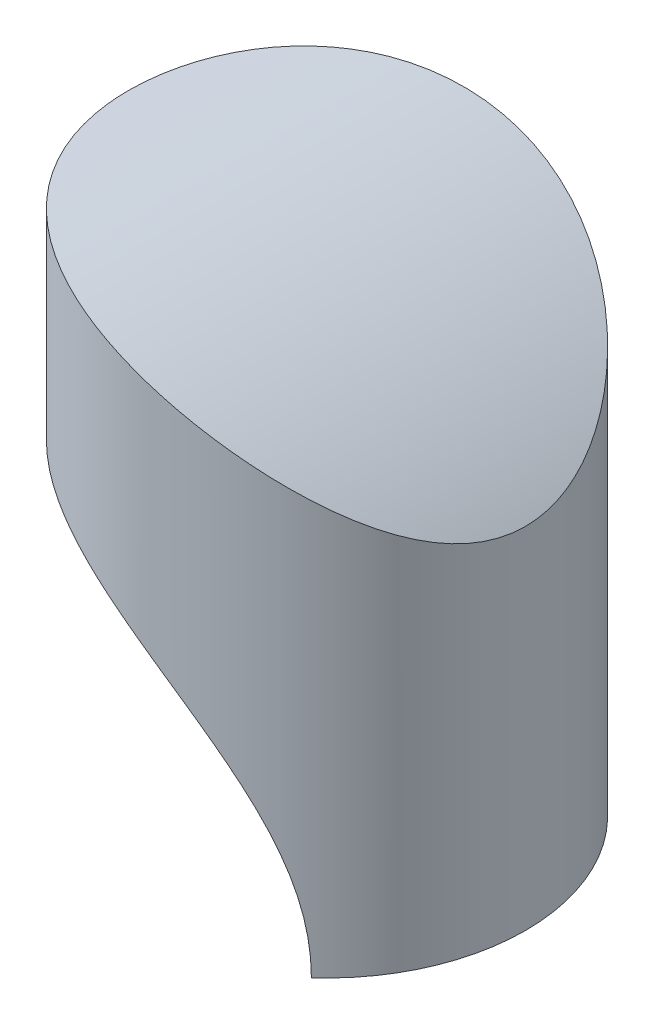
ISO-10303-21;
HEADER;
FILE_DESCRIPTION(('STEP AP214'),'2;1');
FILE_NAME('part.step','',(''),(''),'','','');
FILE_SCHEMA(('AUTOMOTIVE_DESIGN { 1 0 10303 214 1 1 1 1 }'));
ENDSEC;
DATA;
#1=APPLICATION_CONTEXT('core data for automotive mechanical design processes');
#2=APPLICATION_PROTOCOL_DEFINITION('international standard','automotive_design',2000,#1);
#3=PRODUCT_CONTEXT('',#1,'mechanical');
#4=PRODUCT('Part','Part','',(#3));
#5=PRODUCT_RELATED_PRODUCT_CATEGORY('part','',(#4));
#6=PRODUCT_DEFINITION_FORMATION('','',#4);
#7=PRODUCT_DEFINITION_CONTEXT('part definition',#1,'design');
#8=PRODUCT_DEFINITION('design','',#6,#7);
#9=PRODUCT_DEFINITION_SHAPE('','',#8);
#10=(LENGTH_UNIT() NAMED_UNIT(*) SI_UNIT(.MILLI.,.METRE.));
#11=(NAMED_UNIT(*) PLANE_ANGLE_UNIT() SI_UNIT($,.RADIAN.));
#12=(NAMED_UNIT(*) SI_UNIT($,.STERADIAN.) SOLID_ANGLE_UNIT());
#13=UNCERTAINTY_MEASURE_WITH_UNIT(LENGTH_MEASURE(1.E-05),#10,'distance_accuracy_value','');
#14=(GEOMETRIC_REPRESENTATION_CONTEXT(3) GLOBAL_UNCERTAINTY_ASSIGNED_CONTEXT((#13)) GLOBAL_UNIT_ASSIGNED_CONTEXT((#10,
#11,#12)) REPRESENTATION_CONTEXT('',''));
#15=CARTESIAN_POINT('',(0.,0.,0.));
#16=DIRECTION('',(0.,0.,1.));
#17=DIRECTION('',(1.,0.,0.));
#18=AXIS2_PLACEMENT_3D('',#15,#16,#17);
#19=CARTESIAN_POINT('',(0.,80.,0.));
#20=DIRECTION('',(0.,-1.,0.));
#21=DIRECTION('',(0.,0.,-1.));
#22=AXIS2_PLACEMENT_3D('',#19,#20,#21);
#23=CYLINDRICAL_SURFACE('',#22,30.);
#24=CARTESIAN_POINT('',(20.,0.,22.3606797749979));
#25=CARTESIAN_POINT('',(20.0000007120072,0.322032795196168,22.3606754142788));
#26=CARTESIAN_POINT('',(19.9968885845418,0.644050729541473,22.3634631745397));
#27=CARTESIAN_POINT('',(19.9844481767636,1.28786526828124,22.3745822765455));
#28=CARTESIAN_POINT('',(19.9751200045152,1.60966187642605,22.3829135219184));
#29=CARTESIAN_POINT('',(19.9378323530027,2.57427303249348,22.4161555757134));
#30=CARTESIAN_POINT('',(19.9005697280598,3.21648542726856,22.4493147447179));
#31=CARTESIAN_POINT('',(19.8015663972087,4.4961051697141,22.5366873813447));
#32=CARTESIAN_POINT('',(19.7398798930536,5.13351999377426,22.5908542230878));
#33=CARTESIAN_POINT('',(19.5923679631962,6.40357391360704,22.7189049766029));
#34=CARTESIAN_POINT('',(19.5065415422359,7.03621281136981,22.7927897013116));
#35=CARTESIAN_POINT('',(19.3118335351873,8.29117331845733,22.9579890602384));
#36=CARTESIAN_POINT('',(19.2031116775069,8.91353575917785,23.0491825273545));
#37=CARTESIAN_POINT('',(18.9627262922306,10.1513076896881,23.2473487904694));
#38=CARTESIAN_POINT('',(18.8310599445511,10.7667163148793,23.3543235258791));
#39=CARTESIAN_POINT('',(18.4022069215164,12.6017754874726,23.695836182878));
#40=CARTESIAN_POINT('',(18.0712273450615,13.8098681559307,23.9509086149779));
#41=CARTESIAN_POINT('',(17.265584003045,16.371731995908,24.5394474119059));
#42=CARTESIAN_POINT('',(16.7767019730055,17.7196037603295,24.8789368739185));
#43=CARTESIAN_POINT('',(15.6876435055173,20.3637891459652,25.579623080266));
#44=CARTESIAN_POINT('',(15.0874524925823,21.6600959879197,25.9408226632668));
#45=CARTESIAN_POINT('',(13.776795017178,24.1999685847225,26.6600824484979));
#46=CARTESIAN_POINT('',(13.0661189570018,25.4434282544687,27.0181352881789));
#47=CARTESIAN_POINT('',(11.5368265795367,27.8701873375007,27.7056718802995));
#48=CARTESIAN_POINT('',(10.7182497048609,29.0535085161619,28.0351659996363));
#49=CARTESIAN_POINT('',(9.20146466586302,31.0545600286145,28.5622052560136));
#50=CARTESIAN_POINT('',(8.52726729178211,31.887375304455,28.7717870837487));
#51=CARTESIAN_POINT('',(7.12179282099093,33.5130811473071,29.1514976781127));
#52=CARTESIAN_POINT('',(6.39051866712704,34.3059737692448,29.3216284770206));
#53=CARTESIAN_POINT('',(4.87475243586057,35.8457271392102,29.6113306343571));
#54=CARTESIAN_POINT('',(4.09037964023866,36.5926843111127,29.7310112195912));
#55=CARTESIAN_POINT('',(2.47074667790061,38.037178771342,29.9091734021724));
#56=CARTESIAN_POINT('',(1.63549851728752,38.7347276361629,29.9676693797467));
#57=CARTESIAN_POINT('',(0.101324041838263,39.9330381950979,30.0074611167176));
#58=CARTESIAN_POINT('',(-0.589114190069803,40.4442366260103,30.0024578112568));
#59=CARTESIAN_POINT('',(-1.99396092145654,41.4294266390447,29.9419140931503));
#60=CARTESIAN_POINT('',(-2.70836670299162,41.9034224197622,29.886379392282));
#61=CARTESIAN_POINT('',(-4.15580053915634,42.8112945850202,29.7196874813412));
#62=CARTESIAN_POINT('',(-4.88882402811233,43.2451806869606,29.608543785761));
#63=CARTESIAN_POINT('',(-6.36722260749556,44.07049379597,29.3261778489684));
#64=CARTESIAN_POINT('',(-7.11259782349516,44.4619203710737,29.1549549966109));
#65=CARTESIAN_POINT('',(-8.61303237496746,45.2029010936786,28.7475888129971));
#66=CARTESIAN_POINT('',(-9.36812315195129,45.5521604643577,28.5110226429953));
#67=CARTESIAN_POINT('',(-10.874362982846,46.2048016217451,27.9712024822774));
#68=CARTESIAN_POINT('',(-11.6255119978487,46.5081829564224,27.6679478345595));
#69=CARTESIAN_POINT('',(-13.1143742565686,47.0691881256482,26.9940867796003));
#70=CARTESIAN_POINT('',(-13.852090443627,47.3268220951215,26.6234953271348));
#71=CARTESIAN_POINT('',(-15.3048150724499,47.7978514797257,25.8157539120352));
#72=CARTESIAN_POINT('',(-16.0198254250402,48.0112506258694,25.3786095682436));
#73=CARTESIAN_POINT('',(-17.3433354622661,48.3759099505508,24.4902938408875));
#74=CARTESIAN_POINT('',(-17.9550515799704,48.5313736782875,24.0456144428462));
#75=CARTESIAN_POINT('',(-19.147244849467,48.8118087804994,23.1075360317343));
#76=CARTESIAN_POINT('',(-19.7277245549004,48.9367826505441,22.6141410106434));
#77=CARTESIAN_POINT('',(-20.8521866803901,49.1593954217406,21.5816823683517));
#78=CARTESIAN_POINT('',(-21.3961667304699,49.2570325491807,21.0426157867613));
#79=CARTESIAN_POINT('',(-22.4429677126788,49.4284599230223,19.9223728166638));
#80=CARTESIAN_POINT('',(-22.9457871322859,49.5022492933881,19.3411948821766));
#81=CARTESIAN_POINT('',(-23.9111155260234,49.6302832974213,18.1345403863541));
#82=CARTESIAN_POINT('',(-24.3731665934666,49.6843232193419,17.5086760313379));
#83=CARTESIAN_POINT('',(-25.2477327091232,49.7755896537559,16.2221163163369));
#84=CARTESIAN_POINT('',(-25.6602479362019,49.8128162269606,15.5614210821325));
#85=CARTESIAN_POINT('',(-26.432930528398,49.8741045461954,14.2093826939775));
#86=CARTESIAN_POINT('',(-26.7930890576256,49.8981640720007,13.5180343925458));
#87=CARTESIAN_POINT('',(-27.4586023119205,49.936483961115,12.1091773861067));
#88=CARTESIAN_POINT('',(-27.7639550445263,49.9507439682165,11.3916677311454));
#89=CARTESIAN_POINT('',(-28.3338101685395,49.9730911764176,9.89313275027178));
#90=CARTESIAN_POINT('',(-28.5949624252135,49.9807771511708,9.11082546349858));
#91=CARTESIAN_POINT('',(-29.0519959427058,49.9915349912337,7.52732920975946));
#92=CARTESIAN_POINT('',(-29.2478749657634,49.9946066983653,6.72613959645921));
#93=CARTESIAN_POINT('',(-29.5730343336472,49.9984417856567,5.11027156542155));
#94=CARTESIAN_POINT('',(-29.7023084205801,49.9992049489491,4.29559188763914));
#95=CARTESIAN_POINT('',(-29.8933506891409,49.9999775899747,2.65835772952854));
#96=CARTESIAN_POINT('',(-29.9551185925658,49.9999870646018,1.83580321676107));
#97=CARTESIAN_POINT('',(-30.0113435385118,50.0000073249414,0.17012593631239));
#98=CARTESIAN_POINT('',(-30.0042783182259,50.0000181350591,-0.673048622615571));
#99=CARTESIAN_POINT('',(-29.9192223460036,49.9999526042911,-2.35582379875937));
#100=CARTESIAN_POINT('',(-29.8412302441146,49.9998762617468,-3.19542434764544));
#101=CARTESIAN_POINT('',(-29.6148603705289,49.9986445401902,-4.86517667399609));
#102=CARTESIAN_POINT('',(-29.4664749660278,49.9974890441514,-5.69532741681236));
#103=CARTESIAN_POINT('',(-29.1003701868261,49.9922407644513,-7.34018748830894));
#104=CARTESIAN_POINT('',(-28.8826509747021,49.9881479876774,-8.15489685319201));
#105=CARTESIAN_POINT('',(-28.3791588023074,49.9743565540768,-9.76395193509776));
#106=CARTESIAN_POINT('',(-28.0933112296415,49.9646517343499,-10.5582742608298));
#107=CARTESIAN_POINT('',(-27.455772499908,49.9362458810625,-12.1198935841991));
#108=CARTESIAN_POINT('',(-27.1040809224778,49.9175447900666,-12.8871904092625));
#109=CARTESIAN_POINT('',(-26.3375003201844,49.8671591650064,-14.3891252195662));
#110=CARTESIAN_POINT('',(-25.922610570355,49.8354744819962,-15.1237628300374));
#111=CARTESIAN_POINT('',(-25.0329260261727,49.7546740356577,-16.5548307334744));
#112=CARTESIAN_POINT('',(-24.5581323281447,49.7055585913065,-17.2512617253395));
#113=CARTESIAN_POINT('',(-23.5596749276058,49.585999703438,-18.5911260730562));
#114=CARTESIAN_POINT('',(-23.0367848666217,49.5158631640434,-19.2351629532864));
#115=CARTESIAN_POINT('',(-21.9413268281061,49.3494132062156,-20.4759119298972));
#116=CARTESIAN_POINT('',(-21.3687592511697,49.2530999988552,-21.0726244078235));
#117=CARTESIAN_POINT('',(-20.1798101846198,49.0298828128749,-22.2138212543104));
#118=CARTESIAN_POINT('',(-19.5634521509425,48.9029951253602,-22.7583332217856));
#119=CARTESIAN_POINT('',(-18.29312430722,48.6145355751604,-23.791421008311));
#120=CARTESIAN_POINT('',(-17.6391566754518,48.452965719723,-24.2800000619982));
#121=CARTESIAN_POINT('',(-16.3376522039242,48.101655976305,-25.1727898170676));
#122=CARTESIAN_POINT('',(-15.6917307172196,47.9139477267398,-25.5801585067931));
#123=CARTESIAN_POINT('',(-14.3795496143165,47.5023597842692,-26.3401467622484));
#124=CARTESIAN_POINT('',(-13.7132909074591,47.2784817067144,-26.6927687715958));
#125=CARTESIAN_POINT('',(-12.3675923302082,46.7932649449712,-27.3422895659653));
#126=CARTESIAN_POINT('',(-11.6881551089748,46.5319337235383,-27.6391994248037));
#127=CARTESIAN_POINT('',(-10.3230202848477,45.9713051659784,-28.1775378301916));
#128=CARTESIAN_POINT('',(-9.63732264186882,45.6720075865957,-28.4189660212345));
#129=CARTESIAN_POINT('',(-8.28421424749744,45.0440511922714,-28.8420054626911));
#130=CARTESIAN_POINT('',(-7.61678931122461,44.7163522310963,-29.0250025699406));
#131=CARTESIAN_POINT('',(-6.28825900307218,44.0262836836153,-29.3415086448348));
#132=CARTESIAN_POINT('',(-5.62715335085035,43.6639156432581,-29.4750198178423));
#133=CARTESIAN_POINT('',(-4.31615984967432,42.9058718504079,-29.6953319020246));
#134=CARTESIAN_POINT('',(-3.66627523330004,42.5101866865924,-29.7821195633457));
#135=CARTESIAN_POINT('',(-2.38222694549023,41.6874135342486,-29.9122321078421));
#136=CARTESIAN_POINT('',(-1.74806547482792,41.2603211824583,-29.9555509397954));
#137=CARTESIAN_POINT('',(-0.266229887959806,40.2119984500436,-30.0110792880787));
#138=CARTESIAN_POINT('',(0.572938316142759,39.5777351900908,-30.0056786905613));
#139=CARTESIAN_POINT('',(2.20784237388017,38.2591042666739,-29.9298471619471));
#140=CARTESIAN_POINT('',(3.00356465452019,37.5747210997653,-29.8593960300645));
#141=CARTESIAN_POINT('',(4.54803244650715,36.1598144474205,-29.6634851409777));
#142=CARTESIAN_POINT('',(5.29669474729027,35.4292135755935,-29.5379309151686));
#143=CARTESIAN_POINT('',(6.74247477693096,33.9275312606899,-29.2418138714104));
#144=CARTESIAN_POINT('',(7.43959122210006,33.1564488102848,-29.0712499330307));
#145=CARTESIAN_POINT('',(9.01315813610168,31.3036630208063,-28.62940291721));
#146=CARTESIAN_POINT('',(9.86796519609071,30.2069702701242,-28.3437038663316));
#147=CARTESIAN_POINT('',(11.4787612637585,27.9541000039737,-27.7305082961085));
#148=CARTESIAN_POINT('',(12.2347100161591,26.7978985218533,-27.4029948564885));
#149=CARTESIAN_POINT('',(13.6473164719533,24.4298042397965,-26.7275945129411));
#150=CARTESIAN_POINT('',(14.3038325736173,23.2178351628543,-26.3796795146793));
#151=CARTESIAN_POINT('',(15.5148060958311,20.7436496582048,-25.6861325715226));
#152=CARTESIAN_POINT('',(16.0692895349248,19.4814461405168,-25.3405000663214));
#153=CARTESIAN_POINT('',(16.9992844992635,17.1011022825331,-24.7242319868118));
#154=CARTESIAN_POINT('',(17.3891499517116,15.9894718176954,-24.4500896071285));
#155=CARTESIAN_POINT('',(18.0912502692584,13.7341412475779,-23.9352511498763));
#156=CARTESIAN_POINT('',(18.4034791524828,12.5904386787025,-23.6945576501633));
#157=CARTESIAN_POINT('',(18.9462832196207,10.2792748952481,-23.2628192732327));
#158=CARTESIAN_POINT('',(19.1771851212141,9.1119291394487,-23.0715765789261));
#159=CARTESIAN_POINT('',(19.4611490931167,7.34511777006618,-22.8315291795313));
#160=CARTESIAN_POINT('',(19.5453963071855,6.75365350663491,-22.7593247033559));
#161=CARTESIAN_POINT('',(19.6927942690486,5.56631123475889,-22.6319123394848));
#162=CARTESIAN_POINT('',(19.7559484895695,4.97043396939474,-22.5767016540683));
#163=CARTESIAN_POINT('',(19.8402424451633,4.01033718995873,-22.5025893759362));
#164=CARTESIAN_POINT('',(19.8681391058943,3.64712933464437,-22.4779461591788));
#165=CARTESIAN_POINT('',(19.9160021551838,2.91984506761127,-22.4355496313517));
#166=CARTESIAN_POINT('',(19.9359699317511,2.55576881914709,-22.4177951143773));
#167=CARTESIAN_POINT('',(19.9679587280086,1.82658653861959,-22.3893078668389));
#168=CARTESIAN_POINT('',(19.9799708590825,1.46147981089019,-22.3785829904299));
#169=CARTESIAN_POINT('',(19.9959932492489,0.73091628121026,-22.3642632935865));
#170=CARTESIAN_POINT('',(20.0000027398654,0.365459449010935,-22.3606691579018));
#171=CARTESIAN_POINT('',(20.,0.,-22.3606797749979));
#172=B_SPLINE_CURVE_WITH_KNOTS('',3,(#24,#25,#26,#27,#28,#29,#30,#31,#32,#33,#34,#35,#36,#37,
#38,#39,#40,#41,#42,#43,#44,#45,#46,#47,#48,#49,#50,#51,#52,#53,#54,#55,#56,#57,#58,#59,#60,#61,
#62,#63,#64,#65,#66,#67,#68,#69,#70,#71,#72,#73,#74,#75,#76,#77,#78,#79,#80,#81,#82,#83,#84,#85,
#86,#87,#88,#89,#90,#91,#92,#93,#94,#95,#96,#97,#98,#99,#100,#101,#102,#103,#104,#105,#106,#107,
#108,#109,#110,#111,#112,#113,#114,#115,#116,#117,#118,#119,#120,#121,#122,#123,#124,#125,#126,
#127,#128,#129,#130,#131,#132,#133,#134,#135,#136,#137,#138,#139,#140,#141,#142,#143,#144,#145,
#146,#147,#148,#149,#150,#151,#152,#153,#154,#155,#156,#157,#158,#159,#160,#161,#162,#163,#164,
#165,#166,#167,#168,#169,#170,#171),.UNSPECIFIED.,.F.,.F.,(4,2,2,2,2,2,2,2,2,2,2,2,2,2,2,2,2,2,
2,2,2,2,2,2,2,2,2,2,2,2,2,2,2,2,2,2,2,2,2,2,2,2,2,2,2,2,2,2,2,2,2,2,2,2,2,2,2,2,2,2,2,2,2,2,2,2,
2,2,2,2,2,2,2,4),(0.,0.966041897173042,1.93206700041441,3.86358830300822,5.79084696322992,
7.71818509351831,9.63249812459345,11.5470466080633,15.3773381108382,19.7920871440596,
24.2074146805123,28.631222974111,33.0534186277066,36.3262656432966,39.5989440240817,
42.864500069493,46.129288438217,48.7042121366987,51.2788448168105,53.8528520951256,
56.4268855578533,59.0179824957424,61.609104961754,64.1996526693118,66.789981786575,
69.1034775099661,71.4167838120828,73.7302401755247,76.0437815129958,78.3806657123843,
80.7175414734424,83.0548111566925,85.3921657940368,87.8636618360035,90.3352425994933,
92.8070555390164,95.2788786652116,97.8054887556639,100.332146936136,102.859079146899,
105.386005432462,107.915711961897,110.445434642084,112.975186343701,115.50489175408,
117.999327774276,120.493743681431,122.986833408096,125.47977888484,127.835963185439,
130.192042287518,132.547652578225,134.90327796242,137.197964807966,139.492549377462,
141.787784302972,144.08333869994,147.234390350842,150.386420858199,153.543876437445,
156.701410622915,160.953916273063,165.20814819461,169.468382712619,173.727529351824,
177.352924667821,180.978599232935,184.589537505437,186.394374486242,188.198914174098,
189.294113457851,190.389120934388,191.485349776969,192.581683882948),.UNSPECIFIED.);
#173=CARTESIAN_POINT('',(20.,0.,22.3606797749979));
#174=VERTEX_POINT('',#173);
#175=CARTESIAN_POINT('',(20.,0.,-22.3606797749979));
#176=VERTEX_POINT('',#175);
#177=EDGE_CURVE('E46',#174,#176,#172,.T.);
#178=ORIENTED_EDGE('',*,*,#177,.F.);
#179=CARTESIAN_POINT('',(0.,0.,0.));
#180=DIRECTION('',(0.,1.,0.));
#181=DIRECTION('',(0.,0.,1.));
#182=AXIS2_PLACEMENT_3D('',#179,#180,#181);
#183=CIRCLE('',#182,30.);
#184=EDGE_CURVE('E41',#174,#176,#183,.T.);
#185=ORIENTED_EDGE('',*,*,#184,.T.);
#186=EDGE_LOOP('',(#178,#185));
#187=FACE_BOUND('',#186,.T.);
#188=CARTESIAN_POINT('',(-30.,80.,0.));
#189=CARTESIAN_POINT('',(-29.9999966696779,80.0000021177272,-0.841309037096398));
#190=CARTESIAN_POINT('',(-29.9645839884192,80.0000240843786,-1.68270371882417));
#191=CARTESIAN_POINT('',(-29.8231454257203,79.9998351067755,-3.35985631922953));
#192=CARTESIAN_POINT('',(-29.71708910666,79.9996240620998,-4.19561165127074));
#193=CARTESIAN_POINT('',(-29.4348368614637,79.9981283298476,-5.85673416004635));
#194=CARTESIAN_POINT('',(-29.2585166817126,79.9968417358365,-6.68208024743124));
#195=CARTESIAN_POINT('',(-28.8370152108803,79.9918234915545,-8.31489191769157));
#196=CARTESIAN_POINT('',(-28.59184141797,79.9880921074627,-9.12235943722222));
#197=CARTESIAN_POINT('',(-28.0345136483144,79.9763368132893,-10.7133636927642));
#198=CARTESIAN_POINT('',(-27.7223927205181,79.968315018293,-11.496912019429));
#199=CARTESIAN_POINT('',(-27.0333364942396,79.9457169612319,-13.0349064651485));
#200=CARTESIAN_POINT('',(-26.6563993858627,79.93114051612,-13.7893517708243));
#201=CARTESIAN_POINT('',(-25.8406480226079,79.8928429860922,-15.2633591789575));
#202=CARTESIAN_POINT('',(-25.4018602155906,79.8691258023518,-15.9829360156407));
#203=CARTESIAN_POINT('',(-24.4655737829413,79.8097115751842,-17.3823007796053));
#204=CARTESIAN_POINT('',(-23.9680759834456,79.7740147003158,-18.0620892665662));
#205=CARTESIAN_POINT('',(-22.9212343741437,79.6879237915482,-19.3730893471465));
#206=CARTESIAN_POINT('',(-22.3722060512882,79.6376156889729,-20.0045584362581));
#207=CARTESIAN_POINT('',(-21.2242467945278,79.5192994632617,-21.2186061591811));
#208=CARTESIAN_POINT('',(-20.6253159660054,79.4512913775033,-21.8011848962325));
#209=CARTESIAN_POINT('',(-19.382566187318,79.294780145688,-22.9131233912044));
#210=CARTESIAN_POINT('',(-18.7387537696237,79.2062799778984,-23.4424908666965));
#211=CARTESIAN_POINT('',(-17.4116572948421,79.0062261890648,-24.444331745295));
#212=CARTESIAN_POINT('',(-16.7283741205144,78.8946730834539,-24.9168064200749));
#213=CARTESIAN_POINT('',(-15.3448518830641,78.6492750006257,-25.7912654556278));
#214=CARTESIAN_POINT('',(-14.6453926892869,78.5160177655168,-26.1946494045429));
#215=CARTESIAN_POINT('',(-13.2205193650013,78.2238954407558,-26.9418817711387));
#216=CARTESIAN_POINT('',(-12.4951057454563,78.0650308550186,-27.2857313600917));
#217=CARTESIAN_POINT('',(-11.0246007204078,77.7206815312137,-27.9123067188471));
#218=CARTESIAN_POINT('',(-10.2795118474604,77.5352002056975,-28.1950403127467));
#219=CARTESIAN_POINT('',(-8.77581535878486,77.1371430551975,-28.6986720381361));
#220=CARTESIAN_POINT('',(-8.01720767954514,76.9245671028938,-28.9195698790391));
#221=CARTESIAN_POINT('',(-6.49657436048596,76.4736206066713,-29.2985557093956));
#222=CARTESIAN_POINT('',(-5.7345868632827,76.2353895869298,-29.4569635681979));
#223=CARTESIAN_POINT('',(-4.20907396534086,75.7329061485962,-29.7133297328095));
#224=CARTESIAN_POINT('',(-3.44554857856091,75.4686539651513,-29.8112885848242));
#225=CARTESIAN_POINT('',(-1.92211909493251,74.9152157303866,-29.9481302860721));
#226=CARTESIAN_POINT('',(-1.16221576382719,74.626024633704,-29.9870011515144));
#227=CARTESIAN_POINT('',(0.34904584528718,74.0243004413501,-30.0074882178661));
#228=CARTESIAN_POINT('',(1.10040376404374,73.7117663684799,-29.9891020205304));
#229=CARTESIAN_POINT('',(2.63988027410514,73.0437414965011,-29.8942239822885));
#230=CARTESIAN_POINT('',(3.42712543487998,72.6867762836061,-29.8139535494464));
#231=CARTESIAN_POINT('',(4.98278049382145,71.9509946161133,-29.5937351977433));
#232=CARTESIAN_POINT('',(5.75118970611643,71.5721773674985,-29.453785109176));
#233=CARTESIAN_POINT('',(7.26567134729984,70.7954383388863,-29.1172088070087));
#234=CARTESIAN_POINT('',(8.01174120861169,70.3975143764364,-28.920576105976));
#235=CARTESIAN_POINT('',(9.47854795964798,69.5855384715399,-28.4735854857867));
#236=CARTESIAN_POINT('',(10.1992835215365,69.1714856861309,-28.2232247554776));
#237=CARTESIAN_POINT('',(11.7108062351187,68.2721393648296,-27.6333681656122));
#238=CARTESIAN_POINT('',(12.497505709848,67.7849095564326,-27.2863350209572));
#239=CARTESIAN_POINT('',(14.0322092843032,66.7981815920321,-26.5297798737982));
#240=CARTESIAN_POINT('',(14.780209968514,66.29868235886,-26.1202523681623));
#241=CARTESIAN_POINT('',(16.2364038480195,65.2914996887842,-25.2409165193513));
#242=CARTESIAN_POINT('',(16.9445272733329,64.783803792162,-24.7710069719381));
#243=CARTESIAN_POINT('',(18.3174875337462,63.7663752621982,-23.7737178882632));
#244=CARTESIAN_POINT('',(18.9823233376315,63.2566425806423,-23.2463369836961));
#245=CARTESIAN_POINT('',(20.3551032781304,62.1709789476837,-22.0590771957722));
#246=CARTESIAN_POINT('',(21.056381658522,61.5955953676793,-21.3909527655962));
#247=CARTESIAN_POINT('',(22.396825718536,60.4594491155212,-19.9831788746246));
#248=CARTESIAN_POINT('',(23.0359717786371,59.8986911023181,-19.2435069674302));
#249=CARTESIAN_POINT('',(24.2463259400259,58.8047570436229,-17.6940664102471));
#250=CARTESIAN_POINT('',(24.8176611929789,58.2715304703242,-16.884434033755));
#251=CARTESIAN_POINT('',(25.6195328678144,57.5030878287274,-15.6169511414514));
#252=CARTESIAN_POINT('',(25.877578952835,57.2522302229956,-15.1857288667343));
#253=CARTESIAN_POINT('',(26.374486667005,56.7630045661922,-14.3053144934706));
#254=CARTESIAN_POINT('',(26.6133447785268,56.5246388079555,-13.8561191225224));
#255=CARTESIAN_POINT('',(27.1159014649879,56.0171875483037,-12.8492802074368));
#256=CARTESIAN_POINT('',(27.3751661161066,55.7513536043767,-12.2877623820314));
#257=CARTESIAN_POINT('',(27.8620028708801,55.2459206137384,-11.1398956821897));
#258=CARTESIAN_POINT('',(28.0895852809032,55.0063130409238,-10.5535549640709));
#259=CARTESIAN_POINT('',(28.5102864591316,54.5585988158144,-9.35761073830697));
#260=CARTESIAN_POINT('',(28.7034406482556,54.3504598214458,-8.74803193203729));
#261=CARTESIAN_POINT('',(29.0526920862722,53.9707901871153,-7.50709438388464));
#262=CARTESIAN_POINT('',(29.2087883600915,53.7992605104352,-6.87573506941027));
#263=CARTESIAN_POINT('',(29.4826531192485,53.4963206149773,-5.58679901752162));
#264=CARTESIAN_POINT('',(29.5999366458472,53.3654192083133,-4.92899791930906));
#265=CARTESIAN_POINT('',(29.7908649800002,53.1514174294536,-3.59934789070616));
#266=CARTESIAN_POINT('',(29.8645114879864,53.0683151946405,-2.92749950876175));
#267=CARTESIAN_POINT('',(29.9661936706107,52.9533906068281,-1.57657872081063));
#268=CARTESIAN_POINT('',(29.9942712809924,52.921521106076,-0.897513536277088));
#269=CARTESIAN_POINT('',(30.0041433725954,52.9103289231482,0.46134946787878));
#270=CARTESIAN_POINT('',(29.9859433702052,52.9309999780278,1.14114719052554));
#271=CARTESIAN_POINT('',(29.9101050465981,53.0168067990011,2.39071126168615));
#272=CARTESIAN_POINT('',(29.8589270653271,53.0746553122705,2.96139851759318));
#273=CARTESIAN_POINT('',(29.7247817550631,53.225563806866,4.09421224452432));
#274=CARTESIAN_POINT('',(29.6418189271588,53.3186188025383,4.65633991596728));
#275=CARTESIAN_POINT('',(29.445485021369,53.5374247241032,5.76913428577233));
#276=CARTESIAN_POINT('',(29.3320936640551,53.6631974533718,6.31979307586307));
#277=CARTESIAN_POINT('',(29.0766579672453,53.9442722553607,7.40674082471117));
#278=CARTESIAN_POINT('',(28.9346087347871,54.0995793704361,7.94302731184613));
#279=CARTESIAN_POINT('',(28.5662504111708,54.4985569609827,9.19443011529562));
#280=CARTESIAN_POINT('',(28.3281956795783,54.7536807709595,9.90246401045416));
#281=CARTESIAN_POINT('',(27.8063358171646,55.3043520752314,11.2851355223063));
#282=CARTESIAN_POINT('',(27.5225152888065,55.5999131692389,11.9597617990741));
#283=CARTESIAN_POINT('',(26.9126204049359,56.2240543828586,13.2754517708205));
#284=CARTESIAN_POINT('',(26.5864652479054,56.5526973674508,13.9164479056693));
#285=CARTESIAN_POINT('',(25.895763933894,57.2354747698265,15.1630228618622));
#286=CARTESIAN_POINT('',(25.5312166906149,57.5896099088167,15.7686006802959));
#287=CARTESIAN_POINT('',(24.6267707155912,58.4502736114053,17.1592294605373));
#288=CARTESIAN_POINT('',(24.0714477365987,58.9652318120108,17.9290746130137));
#289=CARTESIAN_POINT('',(22.89965113545,60.0187335223485,19.4034296024328));
#290=CARTESIAN_POINT('',(22.283156560253,60.557285077965,20.1079168914235));
#291=CARTESIAN_POINT('',(20.9926445771105,61.647906709303,21.4517394607491));
#292=CARTESIAN_POINT('',(20.3185892481824,62.1999855233418,22.0910311723048));
#293=CARTESIAN_POINT('',(18.9165207331822,63.3085518237843,23.3028686908688));
#294=CARTESIAN_POINT('',(18.1885135351194,63.8650388148285,23.8754218869565));
#295=CARTESIAN_POINT('',(16.6697527608832,64.9833585973503,24.9600310658743));
#296=CARTESIAN_POINT('',(15.8782157548581,65.5451446751177,25.471039262298));
#297=CARTESIAN_POINT('',(14.2450531637596,66.6584725198433,26.4191203987925));
#298=CARTESIAN_POINT('',(13.4034240627571,67.2100135641362,26.8561881407418));
#299=CARTESIAN_POINT('',(11.6744217939298,68.2955588147142,27.6516245879236));
#300=CARTESIAN_POINT('',(10.7871014139748,68.829582141021,28.0100817015066));
#301=CARTESIAN_POINT('',(8.97008501154102,69.8743875704579,28.6437229784301));
#302=CARTESIAN_POINT('',(8.04039709070026,70.3851740799768,28.9189229861808));
#303=CARTESIAN_POINT('',(6.29809851868495,71.2969280918835,29.3428365712709));
#304=CARTESIAN_POINT('',(5.49098781170783,71.7022606822898,29.5048322667064));
#305=CARTESIAN_POINT('',(3.85487931652588,72.4891076873421,29.7628213705071));
#306=CARTESIAN_POINT('',(3.02588373114509,72.87062448626,29.858821395567));
#307=CARTESIAN_POINT('',(1.35117861347084,73.6066564961239,29.9813099991418));
#308=CARTESIAN_POINT('',(0.505474414220315,73.9611801528096,30.0078204073905));
#309=CARTESIAN_POINT('',(-1.19699995889881,74.640653139311,29.9881943971456));
#310=CARTESIAN_POINT('',(-2.05377028509287,74.9656020615334,29.9420569775941));
#311=CARTESIAN_POINT('',(-3.77619872735041,75.5854117738224,29.7740336741149));
#312=CARTESIAN_POINT('',(-4.64187981609131,75.880097706885,29.6517335918531));
#313=CARTESIAN_POINT('',(-6.3696029305363,76.435775324512,29.3291721974347));
#314=CARTESIAN_POINT('',(-7.23164491469698,76.696766625425,29.1289099976954));
#315=CARTESIAN_POINT('',(-8.94330643381728,77.1842429589856,28.6497274814192));
#316=CARTESIAN_POINT('',(-9.79292929860597,77.4107374002929,28.3708286715816));
#317=CARTESIAN_POINT('',(-11.4710527832239,77.8294665285892,27.7348133447483));
#318=CARTESIAN_POINT('',(-12.2995553328082,78.0217043552761,27.3777040026226));
#319=CARTESIAN_POINT('',(-13.847489933902,78.355991915971,26.6254411407505));
#320=CARTESIAN_POINT('',(-14.5697025636048,78.5011020953585,26.2373460004283));
#321=CARTESIAN_POINT('',(-15.9832633507449,78.7657799350589,25.4009757563175));
#322=CARTESIAN_POINT('',(-16.6746136722198,78.885349388497,24.9527048808579));
#323=CARTESIAN_POINT('',(-18.0203164345307,79.1008950685924,23.9989225169101));
#324=CARTESIAN_POINT('',(-18.6746755697789,79.1968755748089,23.4934214355962));
#325=CARTESIAN_POINT('',(-19.9409826752569,79.3676536482531,22.4285878660731));
#326=CARTESIAN_POINT('',(-20.5529304328268,79.4424511092702,21.8692551079738));
#327=CARTESIAN_POINT('',(-21.7149109334274,79.5719216849604,20.7151316781099));
#328=CARTESIAN_POINT('',(-22.2660954685503,79.6270440820298,20.1215497964844));
#329=CARTESIAN_POINT('',(-23.3191651458987,79.7223057392068,18.891063736999));
#330=CARTESIAN_POINT('',(-23.8210511572083,79.7624452634825,18.2541603231901));
#331=CARTESIAN_POINT('',(-24.7721148918187,79.8304246880524,16.9410696590396));
#332=CARTESIAN_POINT('',(-25.2212670205067,79.8582586337585,16.2648635690666));
#333=CARTESIAN_POINT('',(-26.0634189432747,79.9042003522811,14.8780487160135));
#334=CARTESIAN_POINT('',(-26.4564189012308,79.9223081534831,14.1674400533429));
#335=CARTESIAN_POINT('',(-27.1921441203366,79.9515775380946,12.6994922269263));
#336=CARTESIAN_POINT('',(-27.5334674284784,79.962565492593,11.9414466603745));
#337=CARTESIAN_POINT('',(-28.15209219625,79.979253942687,10.39951234527));
#338=CARTESIAN_POINT('',(-28.4293859910047,79.9849538054996,9.61562051552302));
#339=CARTESIAN_POINT('',(-28.9175653191658,79.9930488470811,8.02884539273715));
#340=CARTESIAN_POINT('',(-29.1285602990266,79.995449494557,7.22599577666769));
#341=CARTESIAN_POINT('',(-29.4832404251074,79.9985282131846,5.60587143274522));
#342=CARTESIAN_POINT('',(-29.6269536246771,79.9992070027928,4.78860286468096));
#343=CARTESIAN_POINT('',(-29.8242622847189,79.9998536953043,3.30956855504783));
#344=CARTESIAN_POINT('',(-29.890136567982,79.9999366751851,2.64941298759803));
#345=CARTESIAN_POINT('',(-29.9780067641785,80.0000089929904,1.32618935165863));
#346=CARTESIAN_POINT('',(-30.0000026249658,79.9999983308036,0.663121279708703));
#347=CARTESIAN_POINT('',(-30.,80.,0.));
#348=B_SPLINE_CURVE_WITH_KNOTS('',3,(#188,#189,#190,#191,#192,#193,#194,#195,#196,#197,#198,
#199,#200,#201,#202,#203,#204,#205,#206,#207,#208,#209,#210,#211,#212,#213,#214,#215,#216,#217,
#218,#219,#220,#221,#222,#223,#224,#225,#226,#227,#228,#229,#230,#231,#232,#233,#234,#235,#236,
#237,#238,#239,#240,#241,#242,#243,#244,#245,#246,#247,#248,#249,#250,#251,#252,#253,#254,#255,
#256,#257,#258,#259,#260,#261,#262,#263,#264,#265,#266,#267,#268,#269,#270,#271,#272,#273,#274,
#275,#276,#277,#278,#279,#280,#281,#282,#283,#284,#285,#286,#287,#288,#289,#290,#291,#292,#293,
#294,#295,#296,#297,#298,#299,#300,#301,#302,#303,#304,#305,#306,#307,#308,#309,#310,#311,#312,
#313,#314,#315,#316,#317,#318,#319,#320,#321,#322,#323,#324,#325,#326,#327,#328,#329,#330,#331,
#332,#333,#334,#335,#336,#337,#338,#339,#340,#341,#342,#343,#344,#345,#346,#347),.UNSPECIFIED.,
.T.,.F.,(4,2,2,2,2,2,2,2,2,2,2,2,2,2,2,2,2,2,2,2,2,2,2,2,2,2,2,2,2,2,2,2,2,2,2,2,2,2,2,2,2,2,2,
2,2,2,2,2,2,2,2,2,2,2,2,2,2,2,2,2,2,2,2,2,2,2,2,2,2,2,2,2,2,2,2,2,2,2,2,4),(0.,2.52333174191376,
5.0477513940619,7.57665514622235,10.105283607029,12.632666652867,15.1601202835587,
17.6864964147801,20.2128370003993,22.7246105891792,25.2363788738076,27.7477823332842,
30.259129647199,32.7112526083991,35.1633273213226,37.6150879323806,40.0668600648862,
42.5059141301967,44.9449461563666,47.3844727831086,49.8241015922025,52.4257849198897,
55.027562842126,57.6296386610977,60.2318506588258,63.193754935841,66.1559201830533,
69.1231166016592,72.0903836801319,75.466150774313,78.8429803952219,82.2133746125614,
83.8977543936459,85.5824422616334,87.6004117448123,89.6177232322204,91.632947108387,
93.6482240035415,95.6878062107692,97.7273089350533,99.7649336972894,101.802315581767,
103.527967476584,105.253375090116,106.979935488777,108.706790925208,111.071248399918,
113.436503043662,115.806340377675,118.176244783895,121.411483693835,124.647834617402,
127.886334342811,131.124475170412,134.411667166974,137.699090161965,140.982796823598,
144.265878179193,147.015894986551,149.765636038291,152.514513172284,155.263428185038,
158.027424871513,160.79145302644,163.554725966254,166.317745515318,168.812544912527,
171.307169100968,173.801340374492,176.295524153422,178.72842867175,181.161290292684,
183.595327874226,186.029358352068,188.520711137232,191.012362003989,193.499877763251,
195.986355419247,197.975247623533,199.964142191458),.UNSPECIFIED.);
#349=CARTESIAN_POINT('',(-30.,80.,0.));
#350=VERTEX_POINT('',#349);
#351=EDGE_CURVE('E54',#350,#350,#348,.T.);
#352=ORIENTED_EDGE('',*,*,#351,.T.);
#353=EDGE_LOOP('',(#352));
#354=FACE_BOUND('',#353,.T.);
#355=ADVANCED_FACE('F33',(#187,#354),#23,.T.);
#356=CARTESIAN_POINT('',(0.,0.,0.));
#357=DIRECTION('',(0.,1.,0.));
#358=DIRECTION('',(0.,0.,1.));
#359=AXIS2_PLACEMENT_3D('',#356,#357,#358);
#360=PLANE('',#359);
#361=DIRECTION('',(0.,0.,-1.));
#362=VECTOR('',#361,1.);
#363=CARTESIAN_POINT('',(20.,0.,70.));
#364=LINE('',#363,#362);
#365=EDGE_CURVE('E11',#176,#174,#364,.F.);
#366=ORIENTED_EDGE('',*,*,#365,.F.);
#367=ORIENTED_EDGE('',*,*,#184,.F.);
#368=EDGE_LOOP('',(#366,#367));
#369=FACE_BOUND('',#368,.T.);
#370=ADVANCED_FACE('F56',(#369),#360,.F.);
#371=CARTESIAN_POINT('',(-30.,0.,70.));
#372=DIRECTION('',(0.,0.,-1.));
#373=DIRECTION('',(-1.,0.,0.));
#374=AXIS2_PLACEMENT_3D('',#371,#372,#373);
#375=CYLINDRICAL_SURFACE('',#374,50.);
#376=ORIENTED_EDGE('',*,*,#177,.T.);
#377=ORIENTED_EDGE('',*,*,#365,.T.);
#378=EDGE_LOOP('',(#376,#377));
#379=FACE_BOUND('',#378,.T.);
#380=ADVANCED_FACE('F48',(#379),#375,.F.);
#381=CARTESIAN_POINT('',(-30.,0.,-30.));
#382=DIRECTION('',(0.,0.,1.));
#383=DIRECTION('',(1.,0.,0.));
#384=AXIS2_PLACEMENT_3D('',#381,#382,#383);
#385=CYLINDRICAL_SURFACE('',#384,80.);
#386=ORIENTED_EDGE('',*,*,#351,.F.);
#387=EDGE_LOOP('',(#386));
#388=FACE_BOUND('',#387,.T.);
#389=ADVANCED_FACE('F67',(#388),#385,.T.);
#390=CLOSED_SHELL('',(#355,#370,#380,#389));
#391=MANIFOLD_SOLID_BREP('B2',#390);
#392=ADVANCED_BREP_SHAPE_REPRESENTATION('',(#18,#391),#14);
#393=SHAPE_DEFINITION_REPRESENTATION(#9,#392);
ENDSEC;
END-ISO-10303-21;
